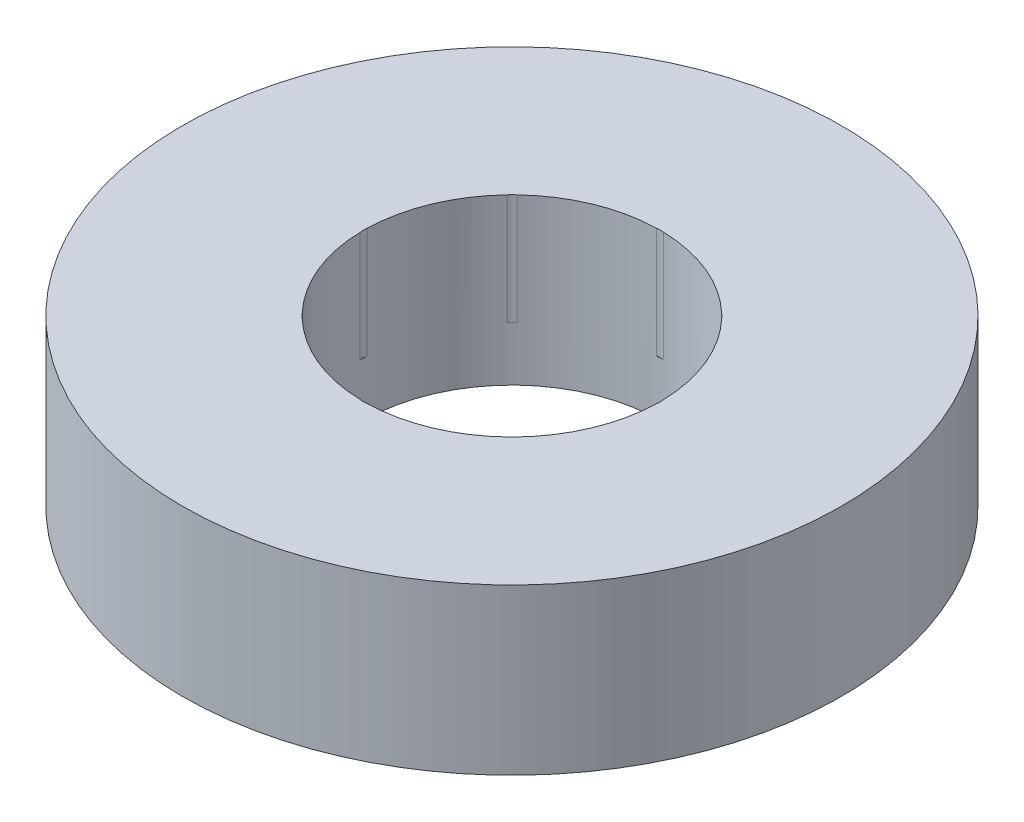
ISO-10303-21;
HEADER;
FILE_DESCRIPTION(('STEP AP214'),'2;1');
FILE_NAME('part.step','',(''),(''),'','','');
FILE_SCHEMA(('AUTOMOTIVE_DESIGN { 1 0 10303 214 1 1 1 1 }'));
ENDSEC;
DATA;
#1=APPLICATION_CONTEXT('core data for automotive mechanical design processes');
#2=APPLICATION_PROTOCOL_DEFINITION('international standard','automotive_design',2000,#1);
#3=PRODUCT_CONTEXT('',#1,'mechanical');
#4=PRODUCT('Part','Part','',(#3));
#5=PRODUCT_RELATED_PRODUCT_CATEGORY('part','',(#4));
#6=PRODUCT_DEFINITION_FORMATION('','',#4);
#7=PRODUCT_DEFINITION_CONTEXT('part definition',#1,'design');
#8=PRODUCT_DEFINITION('design','',#6,#7);
#9=PRODUCT_DEFINITION_SHAPE('','',#8);
#10=(LENGTH_UNIT() NAMED_UNIT(*) SI_UNIT(.MILLI.,.METRE.));
#11=(NAMED_UNIT(*) PLANE_ANGLE_UNIT() SI_UNIT($,.RADIAN.));
#12=(NAMED_UNIT(*) SI_UNIT($,.STERADIAN.) SOLID_ANGLE_UNIT());
#13=UNCERTAINTY_MEASURE_WITH_UNIT(LENGTH_MEASURE(1.E-05),#10,'distance_accuracy_value','');
#14=(GEOMETRIC_REPRESENTATION_CONTEXT(3) GLOBAL_UNCERTAINTY_ASSIGNED_CONTEXT((#13)) GLOBAL_UNIT_ASSIGNED_CONTEXT((#10,
#11,#12)) REPRESENTATION_CONTEXT('',''));
#15=CARTESIAN_POINT('',(0.,0.,0.));
#16=DIRECTION('',(0.,0.,1.));
#17=DIRECTION('',(1.,0.,0.));
#18=AXIS2_PLACEMENT_3D('',#15,#16,#17);
#19=CARTESIAN_POINT('',(0.,25.,0.));
#20=DIRECTION('',(0.,-1.,0.));
#21=DIRECTION('',(0.,0.,-1.));
#22=AXIS2_PLACEMENT_3D('',#19,#20,#21);
#23=CYLINDRICAL_SURFACE('',#22,50.);
#24=CARTESIAN_POINT('',(0.,25.,0.));
#25=DIRECTION('',(0.,1.,0.));
#26=DIRECTION('',(0.,0.,1.));
#27=AXIS2_PLACEMENT_3D('',#24,#25,#26);
#28=CIRCLE('',#27,50.);
#29=CARTESIAN_POINT('',(0.,25.,50.));
#30=VERTEX_POINT('',#29);
#31=EDGE_CURVE('E183',#30,#30,#28,.T.);
#32=ORIENTED_EDGE('',*,*,#31,.F.);
#33=EDGE_LOOP('',(#32));
#34=FACE_BOUND('',#33,.T.);
#35=CARTESIAN_POINT('',(0.,0.,0.));
#36=DIRECTION('',(0.,1.,0.));
#37=DIRECTION('',(0.,0.,1.));
#38=AXIS2_PLACEMENT_3D('',#35,#36,#37);
#39=CIRCLE('',#38,50.);
#40=CARTESIAN_POINT('',(0.,0.,50.));
#41=VERTEX_POINT('',#40);
#42=EDGE_CURVE('E182',#41,#41,#39,.T.);
#43=ORIENTED_EDGE('',*,*,#42,.T.);
#44=EDGE_LOOP('',(#43));
#45=FACE_BOUND('',#44,.T.);
#46=ADVANCED_FACE('F39',(#34,#45),#23,.T.);
#47=CARTESIAN_POINT('',(0.,25.,0.));
#48=DIRECTION('',(0.,1.,0.));
#49=DIRECTION('',(0.,0.,1.));
#50=AXIS2_PLACEMENT_3D('',#47,#48,#49);
#51=PLANE('',#50);
#52=CARTESIAN_POINT('',(0.,25.,19.1385371020225));
#53=DIRECTION('',(0.,1.,0.));
#54=DIRECTION('',(1.,0.,0.));
#55=AXIS2_PLACEMENT_3D('',#52,#53,#54);
#56=CIRCLE('',#55,3.3980053052125);
#57=CARTESIAN_POINT('',(-0.53884094527424,25.,22.4935468620602));
#58=VERTEX_POINT('',#57);
#59=CARTESIAN_POINT('',(0.538840945274397,25.,22.4935468620601));
#60=VERTEX_POINT('',#59);
#61=EDGE_CURVE('E256',#58,#60,#56,.T.);
#62=ORIENTED_EDGE('',*,*,#61,.F.);
#63=CARTESIAN_POINT('',(0.,25.,0.));
#64=DIRECTION('',(0.,1.,0.));
#65=DIRECTION('',(0.,0.,1.));
#66=AXIS2_PLACEMENT_3D('',#63,#64,#65);
#67=CIRCLE('',#66,22.5);
#68=CARTESIAN_POINT('',(-15.5243214327157,25.,16.2863576054846));
#69=VERTEX_POINT('',#68);
#70=EDGE_CURVE('E175',#69,#58,#67,.T.);
#71=ORIENTED_EDGE('',*,*,#70,.F.);
#72=CARTESIAN_POINT('',(-13.5329893668304,25.,13.5329893668304));
#73=DIRECTION('',(0.,1.,0.));
#74=DIRECTION('',(0.707106781186549,0.,0.707106781186546));
#75=AXIS2_PLACEMENT_3D('',#72,#73,#74);
#76=CIRCLE('',#75,3.3980053052125);
#77=CARTESIAN_POINT('',(-16.2863576054845,25.,15.5243214327157));
#78=VERTEX_POINT('',#77);
#79=EDGE_CURVE('E152',#78,#69,#76,.T.);
#80=ORIENTED_EDGE('',*,*,#79,.F.);
#81=CARTESIAN_POINT('',(-22.4935468620601,25.,0.538840945274318));
#82=VERTEX_POINT('',#81);
#83=EDGE_CURVE('E168',#82,#78,#67,.T.);
#84=ORIENTED_EDGE('',*,*,#83,.F.);
#85=CARTESIAN_POINT('',(-19.1385371020225,25.,0.));
#86=DIRECTION('',(0.,1.,0.));
#87=DIRECTION('',(0.,0.,1.));
#88=AXIS2_PLACEMENT_3D('',#85,#86,#87);
#89=CIRCLE('',#88,3.3980053052125);
#90=CARTESIAN_POINT('',(-22.4935468620601,25.,-0.538840945274318));
#91=VERTEX_POINT('',#90);
#92=EDGE_CURVE('E205',#91,#82,#89,.T.);
#93=ORIENTED_EDGE('',*,*,#92,.F.);
#94=CARTESIAN_POINT('',(-16.2863576054847,25.,-15.5243214327155));
#95=VERTEX_POINT('',#94);
#96=EDGE_CURVE('E181',#95,#91,#67,.T.);
#97=ORIENTED_EDGE('',*,*,#96,.F.);
#98=CARTESIAN_POINT('',(-13.5329893668306,25.,-13.5329893668303));
#99=DIRECTION('',(0.,1.,0.));
#100=DIRECTION('',(-0.707106781186539,0.,0.707106781186556));
#101=AXIS2_PLACEMENT_3D('',#98,#99,#100);
#102=CIRCLE('',#101,3.3980053052125);
#103=CARTESIAN_POINT('',(-15.5243214327159,25.,-16.2863576054844));
#104=VERTEX_POINT('',#103);
#105=EDGE_CURVE('E453',#104,#95,#102,.T.);
#106=ORIENTED_EDGE('',*,*,#105,.F.);
#107=CARTESIAN_POINT('',(-0.538840945274554,25.,-22.4935468620601));
#108=VERTEX_POINT('',#107);
#109=EDGE_CURVE('E189',#108,#104,#67,.T.);
#110=ORIENTED_EDGE('',*,*,#109,.F.);
#111=CARTESIAN_POINT('',(-2.00465535433405E-13,25.,-19.1385371020225));
#112=DIRECTION('',(0.,1.,0.));
#113=DIRECTION('',(-1.,0.,0.));
#114=AXIS2_PLACEMENT_3D('',#111,#112,#113);
#115=CIRCLE('',#114,3.3980053052125);
#116=CARTESIAN_POINT('',(0.538840945274082,25.,-22.4935468620602));
#117=VERTEX_POINT('',#116);
#118=EDGE_CURVE('E462',#117,#108,#115,.T.);
#119=ORIENTED_EDGE('',*,*,#118,.F.);
#120=CARTESIAN_POINT('',(15.5243214327155,25.,-16.2863576054847));
#121=VERTEX_POINT('',#120);
#122=EDGE_CURVE('E197',#121,#117,#67,.T.);
#123=ORIENTED_EDGE('',*,*,#122,.F.);
#124=CARTESIAN_POINT('',(13.5329893668303,25.,-13.5329893668305));
#125=DIRECTION('',(0.,1.,0.));
#126=DIRECTION('',(-0.707106781186554,0.,-0.707106781186541));
#127=AXIS2_PLACEMENT_3D('',#124,#125,#126);
#128=CIRCLE('',#127,3.3980053052125);
#129=CARTESIAN_POINT('',(16.2863576054844,25.,-15.5243214327158));
#130=VERTEX_POINT('',#129);
#131=EDGE_CURVE('E470',#130,#121,#128,.T.);
#132=ORIENTED_EDGE('',*,*,#131,.F.);
#133=CARTESIAN_POINT('',(22.4935468620601,25.,-0.538840945274318));
#134=VERTEX_POINT('',#133);
#135=EDGE_CURVE('E489',#134,#130,#67,.T.);
#136=ORIENTED_EDGE('',*,*,#135,.F.);
#137=CARTESIAN_POINT('',(19.1385371020225,25.,0.));
#138=DIRECTION('',(0.,1.,0.));
#139=DIRECTION('',(0.,0.,-1.));
#140=AXIS2_PLACEMENT_3D('',#137,#138,#139);
#141=CIRCLE('',#140,3.3980053052125);
#142=CARTESIAN_POINT('',(22.4935468620601,25.,0.538840945274318));
#143=VERTEX_POINT('',#142);
#144=EDGE_CURVE('E476',#143,#134,#141,.T.);
#145=ORIENTED_EDGE('',*,*,#144,.F.);
#146=CARTESIAN_POINT('',(16.2863576054846,25.,15.5243214327156));
#147=VERTEX_POINT('',#146);
#148=EDGE_CURVE('E491',#147,#143,#67,.T.);
#149=ORIENTED_EDGE('',*,*,#148,.F.);
#150=CARTESIAN_POINT('',(13.5329893668305,25.,13.5329893668303));
#151=DIRECTION('',(0.,1.,0.));
#152=DIRECTION('',(0.707106781186544,0.,-0.707106781186551));
#153=AXIS2_PLACEMENT_3D('',#150,#151,#152);
#154=CIRCLE('',#153,3.3980053052125);
#155=CARTESIAN_POINT('',(15.5243214327158,25.,16.2863576054845));
#156=VERTEX_POINT('',#155);
#157=EDGE_CURVE('E475',#156,#147,#154,.T.);
#158=ORIENTED_EDGE('',*,*,#157,.F.);
#159=EDGE_CURVE('E190',#60,#156,#67,.T.);
#160=ORIENTED_EDGE('',*,*,#159,.F.);
#161=EDGE_LOOP('',(#62,#71,#80,#84,#93,#97,#106,#110,#119,#123,#132,#136,#145,#149,#158,#160));
#162=FACE_BOUND('',#161,.T.);
#163=ORIENTED_EDGE('',*,*,#31,.T.);
#164=EDGE_LOOP('',(#163));
#165=FACE_BOUND('',#164,.T.);
#166=ADVANCED_FACE('F170',(#162,#165),#51,.T.);
#167=CARTESIAN_POINT('',(0.,0.,0.));
#168=DIRECTION('',(0.,1.,0.));
#169=DIRECTION('',(0.,0.,1.));
#170=AXIS2_PLACEMENT_3D('',#167,#168,#169);
#171=PLANE('',#170);
#172=CARTESIAN_POINT('',(0.,0.,0.));
#173=DIRECTION('',(0.,1.,0.));
#174=DIRECTION('',(0.,0.,1.));
#175=AXIS2_PLACEMENT_3D('',#172,#173,#174);
#176=CIRCLE('',#175,22.5);
#177=CARTESIAN_POINT('',(0.,0.,22.5));
#178=VERTEX_POINT('',#177);
#179=EDGE_CURVE('E191',#178,#178,#176,.T.);
#180=ORIENTED_EDGE('',*,*,#179,.T.);
#181=EDGE_LOOP('',(#180));
#182=FACE_BOUND('',#181,.T.);
#183=ORIENTED_EDGE('',*,*,#42,.F.);
#184=EDGE_LOOP('',(#183));
#185=FACE_BOUND('',#184,.T.);
#186=ADVANCED_FACE('F277',(#182,#185),#171,.F.);
#187=CARTESIAN_POINT('',(0.,25.,0.));
#188=DIRECTION('',(0.,-1.,0.));
#189=DIRECTION('',(0.,0.,-1.));
#190=AXIS2_PLACEMENT_3D('',#187,#188,#189);
#191=CYLINDRICAL_SURFACE('',#190,22.5);
#192=DIRECTION('',(0.,1.,0.));
#193=VECTOR('',#192,1.);
#194=CARTESIAN_POINT('',(-0.53884094527428,16.6132652900431,22.4935468620601));
#195=LINE('',#194,#193);
#196=CARTESIAN_POINT('',(-0.53884094527424,8.22653058008623,22.4935468620602));
#197=VERTEX_POINT('',#196);
#198=EDGE_CURVE('E11',#197,#58,#195,.T.);
#199=ORIENTED_EDGE('',*,*,#198,.F.);
#200=CARTESIAN_POINT('',(0.,8.22653058008623,0.));
#201=DIRECTION('',(0.,1.,0.));
#202=DIRECTION('',(0.,0.,1.));
#203=AXIS2_PLACEMENT_3D('',#200,#201,#202);
#204=CIRCLE('',#203,22.5);
#205=CARTESIAN_POINT('',(0.538840945274397,8.22653058008623,22.4935468620601));
#206=VERTEX_POINT('',#205);
#207=EDGE_CURVE('E251',#197,#206,#204,.T.);
#208=ORIENTED_EDGE('',*,*,#207,.T.);
#209=DIRECTION('',(0.,1.,0.));
#210=VECTOR('',#209,1.);
#211=CARTESIAN_POINT('',(0.538840945274437,16.6132652900431,22.4935468620601));
#212=LINE('',#211,#210);
#213=EDGE_CURVE('E46',#60,#206,#212,.F.);
#214=ORIENTED_EDGE('',*,*,#213,.F.);
#215=ORIENTED_EDGE('',*,*,#159,.T.);
#216=DIRECTION('',(0.,1.,0.));
#217=VECTOR('',#216,1.);
#218=CARTESIAN_POINT('',(15.5243214327157,16.6132652900431,16.2863576054845));
#219=LINE('',#218,#217);
#220=CARTESIAN_POINT('',(15.5243214327158,8.22653058008623,16.2863576054845));
#221=VERTEX_POINT('',#220);
#222=EDGE_CURVE('E253',#221,#156,#219,.T.);
#223=ORIENTED_EDGE('',*,*,#222,.F.);
#224=CARTESIAN_POINT('',(0.,8.22653058008623,0.));
#225=DIRECTION('',(0.,1.,0.));
#226=DIRECTION('',(0.,0.,1.));
#227=AXIS2_PLACEMENT_3D('',#224,#225,#226);
#228=CIRCLE('',#227,22.5);
#229=CARTESIAN_POINT('',(16.2863576054846,8.22653058008623,15.5243214327156));
#230=VERTEX_POINT('',#229);
#231=EDGE_CURVE('E246',#221,#230,#228,.T.);
#232=ORIENTED_EDGE('',*,*,#231,.T.);
#233=DIRECTION('',(0.,1.,0.));
#234=VECTOR('',#233,1.);
#235=CARTESIAN_POINT('',(16.2863576054847,16.6132652900431,15.5243214327156));
#236=LINE('',#235,#234);
#237=EDGE_CURVE('E248',#147,#230,#236,.F.);
#238=ORIENTED_EDGE('',*,*,#237,.F.);
#239=ORIENTED_EDGE('',*,*,#148,.T.);
#240=DIRECTION('',(0.,1.,0.));
#241=VECTOR('',#240,1.);
#242=CARTESIAN_POINT('',(22.4935468620601,16.6132652900431,0.538840945274358));
#243=LINE('',#242,#241);
#244=CARTESIAN_POINT('',(22.4935468620601,8.22653058008623,0.538840945274318));
#245=VERTEX_POINT('',#244);
#246=EDGE_CURVE('E243',#245,#143,#243,.T.);
#247=ORIENTED_EDGE('',*,*,#246,.F.);
#248=CARTESIAN_POINT('',(0.,8.22653058008623,0.));
#249=DIRECTION('',(0.,1.,0.));
#250=DIRECTION('',(0.,0.,1.));
#251=AXIS2_PLACEMENT_3D('',#248,#249,#250);
#252=CIRCLE('',#251,22.5);
#253=CARTESIAN_POINT('',(22.4935468620601,8.22653058008623,-0.538840945274318));
#254=VERTEX_POINT('',#253);
#255=EDGE_CURVE('E236',#245,#254,#252,.T.);
#256=ORIENTED_EDGE('',*,*,#255,.T.);
#257=DIRECTION('',(0.,1.,0.));
#258=VECTOR('',#257,1.);
#259=CARTESIAN_POINT('',(22.4935468620601,16.6132652900431,-0.538840945274358));
#260=LINE('',#259,#258);
#261=EDGE_CURVE('E241',#134,#254,#260,.F.);
#262=ORIENTED_EDGE('',*,*,#261,.F.);
#263=ORIENTED_EDGE('',*,*,#135,.T.);
#264=DIRECTION('',(0.,1.,0.));
#265=VECTOR('',#264,1.);
#266=CARTESIAN_POINT('',(16.2863576054844,16.6132652900431,-15.5243214327158));
#267=LINE('',#266,#265);
#268=CARTESIAN_POINT('',(16.2863576054844,8.22653058008623,-15.5243214327158));
#269=VERTEX_POINT('',#268);
#270=EDGE_CURVE('E237',#269,#130,#267,.T.);
#271=ORIENTED_EDGE('',*,*,#270,.F.);
#272=CARTESIAN_POINT('',(0.,8.22653058008623,0.));
#273=DIRECTION('',(0.,1.,0.));
#274=DIRECTION('',(0.,0.,1.));
#275=AXIS2_PLACEMENT_3D('',#272,#273,#274);
#276=CIRCLE('',#275,22.5);
#277=CARTESIAN_POINT('',(15.5243214327155,8.22653058008623,-16.2863576054847));
#278=VERTEX_POINT('',#277);
#279=EDGE_CURVE('E229',#269,#278,#276,.T.);
#280=ORIENTED_EDGE('',*,*,#279,.T.);
#281=DIRECTION('',(0.,1.,0.));
#282=VECTOR('',#281,1.);
#283=CARTESIAN_POINT('',(15.5243214327155,16.6132652900431,-16.2863576054847));
#284=LINE('',#283,#282);
#285=EDGE_CURVE('E232',#121,#278,#284,.F.);
#286=ORIENTED_EDGE('',*,*,#285,.F.);
#287=ORIENTED_EDGE('',*,*,#122,.T.);
#288=DIRECTION('',(0.,1.,0.));
#289=VECTOR('',#288,1.);
#290=CARTESIAN_POINT('',(0.538840945274122,16.6132652900431,-22.4935468620601));
#291=LINE('',#290,#289);
#292=CARTESIAN_POINT('',(0.538840945274082,8.22653058008623,-22.4935468620602));
#293=VERTEX_POINT('',#292);
#294=EDGE_CURVE('E227',#293,#117,#291,.T.);
#295=ORIENTED_EDGE('',*,*,#294,.F.);
#296=CARTESIAN_POINT('',(0.,8.22653058008623,0.));
#297=DIRECTION('',(0.,1.,0.));
#298=DIRECTION('',(0.,0.,1.));
#299=AXIS2_PLACEMENT_3D('',#296,#297,#298);
#300=CIRCLE('',#299,22.5);
#301=CARTESIAN_POINT('',(-0.538840945274554,8.22653058008623,-22.4935468620601));
#302=VERTEX_POINT('',#301);
#303=EDGE_CURVE('E225',#293,#302,#300,.T.);
#304=ORIENTED_EDGE('',*,*,#303,.T.);
#305=DIRECTION('',(0.,1.,0.));
#306=VECTOR('',#305,1.);
#307=CARTESIAN_POINT('',(-0.538840945274594,16.6132652900431,-22.4935468620601));
#308=LINE('',#307,#306);
#309=EDGE_CURVE('E223',#108,#302,#308,.F.);
#310=ORIENTED_EDGE('',*,*,#309,.F.);
#311=ORIENTED_EDGE('',*,*,#109,.T.);
#312=DIRECTION('',(0.,1.,0.));
#313=VECTOR('',#312,1.);
#314=CARTESIAN_POINT('',(-15.5243214327158,16.6132652900431,-16.2863576054844));
#315=LINE('',#314,#313);
#316=CARTESIAN_POINT('',(-15.5243214327159,8.22653058008623,-16.2863576054844));
#317=VERTEX_POINT('',#316);
#318=EDGE_CURVE('E219',#317,#104,#315,.T.);
#319=ORIENTED_EDGE('',*,*,#318,.F.);
#320=CARTESIAN_POINT('',(0.,8.22653058008623,0.));
#321=DIRECTION('',(0.,1.,0.));
#322=DIRECTION('',(0.,0.,1.));
#323=AXIS2_PLACEMENT_3D('',#320,#321,#322);
#324=CIRCLE('',#323,22.5);
#325=CARTESIAN_POINT('',(-16.2863576054847,8.22653058008623,-15.5243214327155));
#326=VERTEX_POINT('',#325);
#327=EDGE_CURVE('E159',#317,#326,#324,.T.);
#328=ORIENTED_EDGE('',*,*,#327,.T.);
#329=DIRECTION('',(0.,1.,0.));
#330=VECTOR('',#329,1.);
#331=CARTESIAN_POINT('',(-16.2863576054848,16.6132652900431,-15.5243214327154));
#332=LINE('',#331,#330);
#333=EDGE_CURVE('E220',#95,#326,#332,.F.);
#334=ORIENTED_EDGE('',*,*,#333,.F.);
#335=ORIENTED_EDGE('',*,*,#96,.T.);
#336=DIRECTION('',(0.,1.,0.));
#337=VECTOR('',#336,1.);
#338=CARTESIAN_POINT('',(-22.4935468620601,16.6132652900431,-0.538840945274358));
#339=LINE('',#338,#337);
#340=CARTESIAN_POINT('',(-22.4935468620601,8.22653058008623,-0.538840945274318));
#341=VERTEX_POINT('',#340);
#342=EDGE_CURVE('E209',#341,#91,#339,.T.);
#343=ORIENTED_EDGE('',*,*,#342,.F.);
#344=CARTESIAN_POINT('',(0.,8.22653058008623,0.));
#345=DIRECTION('',(0.,1.,0.));
#346=DIRECTION('',(0.,0.,1.));
#347=AXIS2_PLACEMENT_3D('',#344,#345,#346);
#348=CIRCLE('',#347,22.5);
#349=CARTESIAN_POINT('',(-22.4935468620601,8.22653058008623,0.538840945274318));
#350=VERTEX_POINT('',#349);
#351=EDGE_CURVE('E206',#341,#350,#348,.T.);
#352=ORIENTED_EDGE('',*,*,#351,.T.);
#353=DIRECTION('',(0.,1.,0.));
#354=VECTOR('',#353,1.);
#355=CARTESIAN_POINT('',(-22.4935468620601,16.6132652900431,0.538840945274358));
#356=LINE('',#355,#354);
#357=EDGE_CURVE('E179',#82,#350,#356,.F.);
#358=ORIENTED_EDGE('',*,*,#357,.F.);
#359=ORIENTED_EDGE('',*,*,#83,.T.);
#360=DIRECTION('',(0.,1.,0.));
#361=VECTOR('',#360,1.);
#362=CARTESIAN_POINT('',(-16.2863576054846,16.6132652900431,15.5243214327157));
#363=LINE('',#362,#361);
#364=CARTESIAN_POINT('',(-16.2863576054845,8.22653058008623,15.5243214327157));
#365=VERTEX_POINT('',#364);
#366=EDGE_CURVE('E147',#365,#78,#363,.T.);
#367=ORIENTED_EDGE('',*,*,#366,.F.);
#368=CARTESIAN_POINT('',(0.,8.22653058008623,0.));
#369=DIRECTION('',(0.,1.,0.));
#370=DIRECTION('',(0.,0.,1.));
#371=AXIS2_PLACEMENT_3D('',#368,#369,#370);
#372=CIRCLE('',#371,22.5);
#373=CARTESIAN_POINT('',(-15.5243214327157,8.22653058008623,16.2863576054846));
#374=VERTEX_POINT('',#373);
#375=EDGE_CURVE('E215',#365,#374,#372,.T.);
#376=ORIENTED_EDGE('',*,*,#375,.T.);
#377=DIRECTION('',(0.,1.,0.));
#378=VECTOR('',#377,1.);
#379=CARTESIAN_POINT('',(-15.5243214327156,16.6132652900431,16.2863576054846));
#380=LINE('',#379,#378);
#381=EDGE_CURVE('E161',#69,#374,#380,.F.);
#382=ORIENTED_EDGE('',*,*,#381,.F.);
#383=ORIENTED_EDGE('',*,*,#70,.T.);
#384=EDGE_LOOP('',(#199,#208,#214,#215,#223,#232,#238,#239,#247,#256,#262,#263,#271,#280,#286,
#287,#295,#304,#310,#311,#319,#328,#334,#335,#343,#352,#358,#359,#367,#376,#382,#383));
#385=FACE_BOUND('',#384,.T.);
#386=ORIENTED_EDGE('',*,*,#179,.F.);
#387=EDGE_LOOP('',(#386));
#388=FACE_BOUND('',#387,.T.);
#389=ADVANCED_FACE('F176',(#385,#388),#191,.F.);
#390=CARTESIAN_POINT('',(-19.1385371020225,8.22653058008623,0.));
#391=DIRECTION('',(0.,1.,0.));
#392=DIRECTION('',(0.,0.,1.));
#393=AXIS2_PLACEMENT_3D('',#390,#391,#392);
#394=CYLINDRICAL_SURFACE('',#393,3.3980053052125);
#395=ORIENTED_EDGE('',*,*,#342,.T.);
#396=ORIENTED_EDGE('',*,*,#92,.T.);
#397=ORIENTED_EDGE('',*,*,#357,.T.);
#398=CARTESIAN_POINT('',(-19.1385371020225,8.22653058008623,0.));
#399=DIRECTION('',(0.,1.,0.));
#400=DIRECTION('',(0.,0.,1.));
#401=AXIS2_PLACEMENT_3D('',#398,#399,#400);
#402=CIRCLE('',#401,3.3980053052125);
#403=EDGE_CURVE('E200',#341,#350,#402,.T.);
#404=ORIENTED_EDGE('',*,*,#403,.F.);
#405=EDGE_LOOP('',(#395,#396,#397,#404));
#406=FACE_BOUND('',#405,.T.);
#407=ADVANCED_FACE('F286',(#406),#394,.F.);
#408=CARTESIAN_POINT('',(-19.1385371020225,8.22653058008623,0.));
#409=DIRECTION('',(0.,1.,0.));
#410=DIRECTION('',(0.,0.,1.));
#411=AXIS2_PLACEMENT_3D('',#408,#409,#410);
#412=PLANE('',#411);
#413=ORIENTED_EDGE('',*,*,#403,.T.);
#414=ORIENTED_EDGE('',*,*,#351,.F.);
#415=EDGE_LOOP('',(#413,#414));
#416=FACE_BOUND('',#415,.T.);
#417=ADVANCED_FACE('F289',(#416),#412,.T.);
#418=CARTESIAN_POINT('',(-13.5329893668304,8.22653058008623,13.5329893668304));
#419=DIRECTION('',(0.,1.,0.));
#420=DIRECTION('',(0.,0.,1.));
#421=AXIS2_PLACEMENT_3D('',#418,#419,#420);
#422=CYLINDRICAL_SURFACE('',#421,3.3980053052125);
#423=ORIENTED_EDGE('',*,*,#366,.T.);
#424=ORIENTED_EDGE('',*,*,#79,.T.);
#425=ORIENTED_EDGE('',*,*,#381,.T.);
#426=CARTESIAN_POINT('',(-13.5329893668304,8.22653058008623,13.5329893668304));
#427=DIRECTION('',(0.,1.,0.));
#428=DIRECTION('',(0.707106781186549,0.,0.707106781186546));
#429=AXIS2_PLACEMENT_3D('',#426,#427,#428);
#430=CIRCLE('',#429,3.3980053052125);
#431=EDGE_CURVE('E156',#365,#374,#430,.T.);
#432=ORIENTED_EDGE('',*,*,#431,.F.);
#433=EDGE_LOOP('',(#423,#424,#425,#432));
#434=FACE_BOUND('',#433,.T.);
#435=ADVANCED_FACE('F155',(#434),#422,.F.);
#436=CARTESIAN_POINT('',(-13.5329893668304,8.22653058008623,13.5329893668304));
#437=DIRECTION('',(0.,1.,0.));
#438=DIRECTION('',(0.707106781186549,0.,0.707106781186546));
#439=AXIS2_PLACEMENT_3D('',#436,#437,#438);
#440=PLANE('',#439);
#441=ORIENTED_EDGE('',*,*,#431,.T.);
#442=ORIENTED_EDGE('',*,*,#375,.F.);
#443=EDGE_LOOP('',(#441,#442));
#444=FACE_BOUND('',#443,.T.);
#445=ADVANCED_FACE('F300',(#444),#440,.T.);
#446=CARTESIAN_POINT('',(-13.5329893668306,8.22653058008623,-13.5329893668303));
#447=DIRECTION('',(0.,1.,0.));
#448=DIRECTION('',(0.,0.,1.));
#449=AXIS2_PLACEMENT_3D('',#446,#447,#448);
#450=CYLINDRICAL_SURFACE('',#449,3.3980053052125);
#451=ORIENTED_EDGE('',*,*,#318,.T.);
#452=ORIENTED_EDGE('',*,*,#105,.T.);
#453=ORIENTED_EDGE('',*,*,#333,.T.);
#454=CARTESIAN_POINT('',(-13.5329893668306,8.22653058008623,-13.5329893668303));
#455=DIRECTION('',(0.,1.,0.));
#456=DIRECTION('',(-0.707106781186539,0.,0.707106781186556));
#457=AXIS2_PLACEMENT_3D('',#454,#455,#456);
#458=CIRCLE('',#457,3.3980053052125);
#459=EDGE_CURVE('E454',#317,#326,#458,.T.);
#460=ORIENTED_EDGE('',*,*,#459,.F.);
#461=EDGE_LOOP('',(#451,#452,#453,#460));
#462=FACE_BOUND('',#461,.T.);
#463=ADVANCED_FACE('F299',(#462),#450,.F.);
#464=CARTESIAN_POINT('',(-13.5329893668306,8.22653058008623,-13.5329893668303));
#465=DIRECTION('',(0.,1.,0.));
#466=DIRECTION('',(-0.707106781186539,0.,0.707106781186556));
#467=AXIS2_PLACEMENT_3D('',#464,#465,#466);
#468=PLANE('',#467);
#469=ORIENTED_EDGE('',*,*,#459,.T.);
#470=ORIENTED_EDGE('',*,*,#327,.F.);
#471=EDGE_LOOP('',(#469,#470));
#472=FACE_BOUND('',#471,.T.);
#473=ADVANCED_FACE('F379',(#472),#468,.T.);
#474=CARTESIAN_POINT('',(-2.00465535433405E-13,8.22653058008623,-19.1385371020225));
#475=DIRECTION('',(0.,1.,0.));
#476=DIRECTION('',(0.,0.,1.));
#477=AXIS2_PLACEMENT_3D('',#474,#475,#476);
#478=CYLINDRICAL_SURFACE('',#477,3.3980053052125);
#479=ORIENTED_EDGE('',*,*,#294,.T.);
#480=ORIENTED_EDGE('',*,*,#118,.T.);
#481=ORIENTED_EDGE('',*,*,#309,.T.);
#482=CARTESIAN_POINT('',(-2.00465535433405E-13,8.22653058008623,-19.1385371020225));
#483=DIRECTION('',(0.,1.,0.));
#484=DIRECTION('',(-1.,0.,0.));
#485=AXIS2_PLACEMENT_3D('',#482,#483,#484);
#486=CIRCLE('',#485,3.3980053052125);
#487=EDGE_CURVE('E465',#293,#302,#486,.T.);
#488=ORIENTED_EDGE('',*,*,#487,.F.);
#489=EDGE_LOOP('',(#479,#480,#481,#488));
#490=FACE_BOUND('',#489,.T.);
#491=ADVANCED_FACE('F371',(#490),#478,.F.);
#492=CARTESIAN_POINT('',(-2.00465535433405E-13,8.22653058008623,-19.1385371020225));
#493=DIRECTION('',(0.,1.,0.));
#494=DIRECTION('',(-1.,0.,0.));
#495=AXIS2_PLACEMENT_3D('',#492,#493,#494);
#496=PLANE('',#495);
#497=ORIENTED_EDGE('',*,*,#487,.T.);
#498=ORIENTED_EDGE('',*,*,#303,.F.);
#499=EDGE_LOOP('',(#497,#498));
#500=FACE_BOUND('',#499,.T.);
#501=ADVANCED_FACE('F308',(#500),#496,.T.);
#502=CARTESIAN_POINT('',(13.5329893668303,8.22653058008623,-13.5329893668305));
#503=DIRECTION('',(0.,1.,0.));
#504=DIRECTION('',(0.,0.,1.));
#505=AXIS2_PLACEMENT_3D('',#502,#503,#504);
#506=CYLINDRICAL_SURFACE('',#505,3.3980053052125);
#507=ORIENTED_EDGE('',*,*,#270,.T.);
#508=ORIENTED_EDGE('',*,*,#131,.T.);
#509=ORIENTED_EDGE('',*,*,#285,.T.);
#510=CARTESIAN_POINT('',(13.5329893668303,8.22653058008623,-13.5329893668305));
#511=DIRECTION('',(0.,1.,0.));
#512=DIRECTION('',(-0.707106781186554,0.,-0.707106781186541));
#513=AXIS2_PLACEMENT_3D('',#510,#511,#512);
#514=CIRCLE('',#513,3.3980053052125);
#515=EDGE_CURVE('E477',#269,#278,#514,.T.);
#516=ORIENTED_EDGE('',*,*,#515,.F.);
#517=EDGE_LOOP('',(#507,#508,#509,#516));
#518=FACE_BOUND('',#517,.T.);
#519=ADVANCED_FACE('F305',(#518),#506,.F.);
#520=CARTESIAN_POINT('',(13.5329893668303,8.22653058008623,-13.5329893668305));
#521=DIRECTION('',(0.,1.,0.));
#522=DIRECTION('',(-0.707106781186554,0.,-0.707106781186541));
#523=AXIS2_PLACEMENT_3D('',#520,#521,#522);
#524=PLANE('',#523);
#525=ORIENTED_EDGE('',*,*,#515,.T.);
#526=ORIENTED_EDGE('',*,*,#279,.F.);
#527=EDGE_LOOP('',(#525,#526));
#528=FACE_BOUND('',#527,.T.);
#529=ADVANCED_FACE('F304',(#528),#524,.T.);
#530=CARTESIAN_POINT('',(19.1385371020225,8.22653058008623,0.));
#531=DIRECTION('',(0.,1.,0.));
#532=DIRECTION('',(0.,0.,1.));
#533=AXIS2_PLACEMENT_3D('',#530,#531,#532);
#534=CYLINDRICAL_SURFACE('',#533,3.3980053052125);
#535=ORIENTED_EDGE('',*,*,#246,.T.);
#536=ORIENTED_EDGE('',*,*,#144,.T.);
#537=ORIENTED_EDGE('',*,*,#261,.T.);
#538=CARTESIAN_POINT('',(19.1385371020225,8.22653058008623,0.));
#539=DIRECTION('',(0.,1.,0.));
#540=DIRECTION('',(0.,0.,-1.));
#541=AXIS2_PLACEMENT_3D('',#538,#539,#540);
#542=CIRCLE('',#541,3.3980053052125);
#543=EDGE_CURVE('E478',#245,#254,#542,.T.);
#544=ORIENTED_EDGE('',*,*,#543,.F.);
#545=EDGE_LOOP('',(#535,#536,#537,#544));
#546=FACE_BOUND('',#545,.T.);
#547=ADVANCED_FACE('F309',(#546),#534,.F.);
#548=CARTESIAN_POINT('',(19.1385371020225,8.22653058008623,0.));
#549=DIRECTION('',(0.,1.,0.));
#550=DIRECTION('',(0.,0.,-1.));
#551=AXIS2_PLACEMENT_3D('',#548,#549,#550);
#552=PLANE('',#551);
#553=ORIENTED_EDGE('',*,*,#543,.T.);
#554=ORIENTED_EDGE('',*,*,#255,.F.);
#555=EDGE_LOOP('',(#553,#554));
#556=FACE_BOUND('',#555,.T.);
#557=ADVANCED_FACE('F314',(#556),#552,.T.);
#558=CARTESIAN_POINT('',(13.5329893668305,8.22653058008623,13.5329893668303));
#559=DIRECTION('',(0.,1.,0.));
#560=DIRECTION('',(0.,0.,1.));
#561=AXIS2_PLACEMENT_3D('',#558,#559,#560);
#562=CYLINDRICAL_SURFACE('',#561,3.3980053052125);
#563=ORIENTED_EDGE('',*,*,#222,.T.);
#564=ORIENTED_EDGE('',*,*,#157,.T.);
#565=ORIENTED_EDGE('',*,*,#237,.T.);
#566=CARTESIAN_POINT('',(13.5329893668305,8.22653058008623,13.5329893668303));
#567=DIRECTION('',(0.,1.,0.));
#568=DIRECTION('',(0.707106781186544,0.,-0.707106781186551));
#569=AXIS2_PLACEMENT_3D('',#566,#567,#568);
#570=CIRCLE('',#569,3.3980053052125);
#571=EDGE_CURVE('E56',#221,#230,#570,.T.);
#572=ORIENTED_EDGE('',*,*,#571,.F.);
#573=EDGE_LOOP('',(#563,#564,#565,#572));
#574=FACE_BOUND('',#573,.T.);
#575=ADVANCED_FACE('F318',(#574),#562,.F.);
#576=CARTESIAN_POINT('',(13.5329893668305,8.22653058008623,13.5329893668303));
#577=DIRECTION('',(0.,1.,0.));
#578=DIRECTION('',(0.707106781186544,0.,-0.707106781186551));
#579=AXIS2_PLACEMENT_3D('',#576,#577,#578);
#580=PLANE('',#579);
#581=ORIENTED_EDGE('',*,*,#571,.T.);
#582=ORIENTED_EDGE('',*,*,#231,.F.);
#583=EDGE_LOOP('',(#581,#582));
#584=FACE_BOUND('',#583,.T.);
#585=ADVANCED_FACE('F270',(#584),#580,.T.);
#586=CARTESIAN_POINT('',(0.,8.22653058008623,19.1385371020225));
#587=DIRECTION('',(0.,1.,0.));
#588=DIRECTION('',(0.,0.,1.));
#589=AXIS2_PLACEMENT_3D('',#586,#587,#588);
#590=CYLINDRICAL_SURFACE('',#589,3.3980053052125);
#591=ORIENTED_EDGE('',*,*,#198,.T.);
#592=ORIENTED_EDGE('',*,*,#61,.T.);
#593=ORIENTED_EDGE('',*,*,#213,.T.);
#594=CARTESIAN_POINT('',(0.,8.22653058008623,19.1385371020225));
#595=DIRECTION('',(0.,1.,0.));
#596=DIRECTION('',(1.,0.,0.));
#597=AXIS2_PLACEMENT_3D('',#594,#595,#596);
#598=CIRCLE('',#597,3.3980053052125);
#599=EDGE_CURVE('E55',#197,#206,#598,.T.);
#600=ORIENTED_EDGE('',*,*,#599,.F.);
#601=EDGE_LOOP('',(#591,#592,#593,#600));
#602=FACE_BOUND('',#601,.T.);
#603=ADVANCED_FACE('F260',(#602),#590,.F.);
#604=CARTESIAN_POINT('',(0.,8.22653058008623,19.1385371020225));
#605=DIRECTION('',(0.,1.,0.));
#606=DIRECTION('',(1.,0.,0.));
#607=AXIS2_PLACEMENT_3D('',#604,#605,#606);
#608=PLANE('',#607);
#609=ORIENTED_EDGE('',*,*,#599,.T.);
#610=ORIENTED_EDGE('',*,*,#207,.F.);
#611=EDGE_LOOP('',(#609,#610));
#612=FACE_BOUND('',#611,.T.);
#613=ADVANCED_FACE('F261',(#612),#608,.T.);
#614=CLOSED_SHELL('',(#46,#166,#186,#389,#407,#417,#435,#445,#463,#473,#491,#501,#519,#529,#547,
#557,#575,#585,#603,#613));
#615=MANIFOLD_SOLID_BREP('B2',#614);
#616=ADVANCED_BREP_SHAPE_REPRESENTATION('',(#18,#615),#14);
#617=SHAPE_DEFINITION_REPRESENTATION(#9,#616);
ENDSEC;
END-ISO-10303-21;
